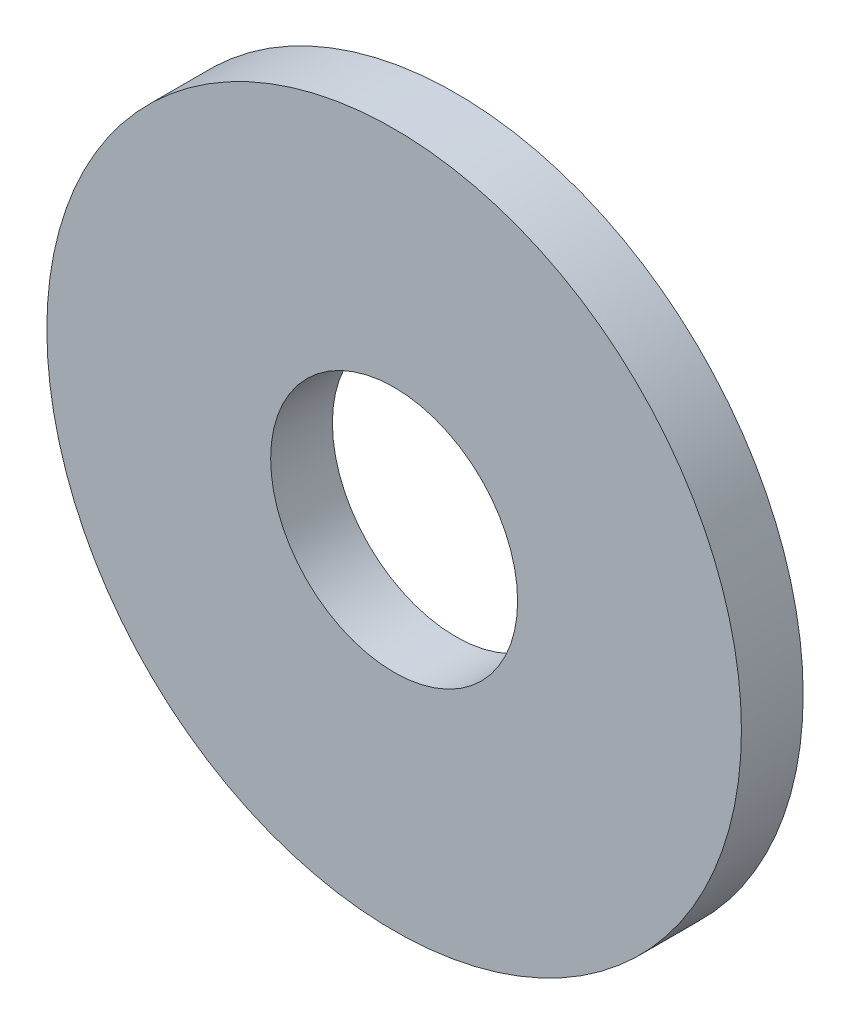
ISO-10303-21;
HEADER;
FILE_DESCRIPTION(('STEP AP214'),'2;1');
FILE_NAME('part.step','',(''),(''),'','','');
FILE_SCHEMA(('AUTOMOTIVE_DESIGN { 1 0 10303 214 1 1 1 1 }'));
ENDSEC;
DATA;
#1=APPLICATION_CONTEXT('core data for automotive mechanical design processes');
#2=APPLICATION_PROTOCOL_DEFINITION('international standard','automotive_design',2000,#1);
#3=PRODUCT_CONTEXT('',#1,'mechanical');
#4=PRODUCT('Part','Part','',(#3));
#5=PRODUCT_RELATED_PRODUCT_CATEGORY('part','',(#4));
#6=PRODUCT_DEFINITION_FORMATION('','',#4);
#7=PRODUCT_DEFINITION_CONTEXT('part definition',#1,'design');
#8=PRODUCT_DEFINITION('design','',#6,#7);
#9=PRODUCT_DEFINITION_SHAPE('','',#8);
#10=(LENGTH_UNIT() NAMED_UNIT(*) SI_UNIT(.MILLI.,.METRE.));
#11=(NAMED_UNIT(*) PLANE_ANGLE_UNIT() SI_UNIT($,.RADIAN.));
#12=(NAMED_UNIT(*) SI_UNIT($,.STERADIAN.) SOLID_ANGLE_UNIT());
#13=UNCERTAINTY_MEASURE_WITH_UNIT(LENGTH_MEASURE(1.E-05),#10,'distance_accuracy_value','');
#14=(GEOMETRIC_REPRESENTATION_CONTEXT(3) GLOBAL_UNCERTAINTY_ASSIGNED_CONTEXT((#13)) GLOBAL_UNIT_ASSIGNED_CONTEXT((#10,
#11,#12)) REPRESENTATION_CONTEXT('',''));
#15=CARTESIAN_POINT('',(0.,0.,0.));
#16=DIRECTION('',(0.,0.,1.));
#17=DIRECTION('',(1.,0.,0.));
#18=AXIS2_PLACEMENT_3D('',#15,#16,#17);
#19=CARTESIAN_POINT('',(0.,0.,0.8));
#20=DIRECTION('',(0.,0.,1.));
#21=DIRECTION('',(1.,0.,0.));
#22=AXIS2_PLACEMENT_3D('',#19,#20,#21);
#23=PLANE('',#22);
#24=CARTESIAN_POINT('',(0.,0.,0.8));
#25=DIRECTION('',(0.,0.,1.));
#26=DIRECTION('',(1.,0.,0.));
#27=AXIS2_PLACEMENT_3D('',#24,#25,#26);
#28=CIRCLE('',#27,4.5);
#29=CARTESIAN_POINT('',(4.5,0.,0.8));
#30=VERTEX_POINT('',#29);
#31=EDGE_CURVE('E10',#30,#30,#28,.T.);
#32=ORIENTED_EDGE('',*,*,#31,.T.);
#33=EDGE_LOOP('',(#32));
#34=FACE_BOUND('',#33,.T.);
#35=CARTESIAN_POINT('',(0.,0.,0.8));
#36=DIRECTION('',(0.,0.,1.));
#37=DIRECTION('',(1.,0.,0.));
#38=AXIS2_PLACEMENT_3D('',#35,#36,#37);
#39=CIRCLE('',#38,1.6);
#40=CARTESIAN_POINT('',(1.6,0.,0.8));
#41=VERTEX_POINT('',#40);
#42=EDGE_CURVE('E51',#41,#41,#39,.T.);
#43=ORIENTED_EDGE('',*,*,#42,.F.);
#44=EDGE_LOOP('',(#43));
#45=FACE_BOUND('',#44,.T.);
#46=ADVANCED_FACE('F36',(#34,#45),#23,.T.);
#47=CARTESIAN_POINT('',(0.,0.,0.));
#48=DIRECTION('',(0.,0.,1.));
#49=DIRECTION('',(1.,0.,0.));
#50=AXIS2_PLACEMENT_3D('',#47,#48,#49);
#51=PLANE('',#50);
#52=CARTESIAN_POINT('',(0.,0.,0.));
#53=DIRECTION('',(0.,0.,1.));
#54=DIRECTION('',(1.,0.,0.));
#55=AXIS2_PLACEMENT_3D('',#52,#53,#54);
#56=CIRCLE('',#55,4.5);
#57=CARTESIAN_POINT('',(4.5,0.,0.));
#58=VERTEX_POINT('',#57);
#59=EDGE_CURVE('E40',#58,#58,#56,.T.);
#60=ORIENTED_EDGE('',*,*,#59,.F.);
#61=EDGE_LOOP('',(#60));
#62=FACE_BOUND('',#61,.T.);
#63=CARTESIAN_POINT('',(0.,0.,0.));
#64=DIRECTION('',(0.,0.,1.));
#65=DIRECTION('',(1.,0.,0.));
#66=AXIS2_PLACEMENT_3D('',#63,#64,#65);
#67=CIRCLE('',#66,1.6);
#68=CARTESIAN_POINT('',(1.6,0.,0.));
#69=VERTEX_POINT('',#68);
#70=EDGE_CURVE('E53',#69,#69,#67,.T.);
#71=ORIENTED_EDGE('',*,*,#70,.T.);
#72=EDGE_LOOP('',(#71));
#73=FACE_BOUND('',#72,.T.);
#74=ADVANCED_FACE('F63',(#62,#73),#51,.F.);
#75=CARTESIAN_POINT('',(0.,0.,0.8));
#76=DIRECTION('',(0.,0.,-1.));
#77=DIRECTION('',(-1.,0.,0.));
#78=AXIS2_PLACEMENT_3D('',#75,#76,#77);
#79=CYLINDRICAL_SURFACE('',#78,4.5);
#80=ORIENTED_EDGE('',*,*,#31,.F.);
#81=EDGE_LOOP('',(#80));
#82=FACE_BOUND('',#81,.T.);
#83=ORIENTED_EDGE('',*,*,#59,.T.);
#84=EDGE_LOOP('',(#83));
#85=FACE_BOUND('',#84,.T.);
#86=ADVANCED_FACE('F38',(#82,#85),#79,.T.);
#87=CARTESIAN_POINT('',(0.,0.,0.8));
#88=DIRECTION('',(0.,0.,-1.));
#89=DIRECTION('',(-1.,0.,0.));
#90=AXIS2_PLACEMENT_3D('',#87,#88,#89);
#91=CYLINDRICAL_SURFACE('',#90,1.6);
#92=ORIENTED_EDGE('',*,*,#42,.T.);
#93=EDGE_LOOP('',(#92));
#94=FACE_BOUND('',#93,.T.);
#95=ORIENTED_EDGE('',*,*,#70,.F.);
#96=EDGE_LOOP('',(#95));
#97=FACE_BOUND('',#96,.T.);
#98=ADVANCED_FACE('F59',(#94,#97),#91,.F.);
#99=CLOSED_SHELL('',(#46,#74,#86,#98));
#100=MANIFOLD_SOLID_BREP('B2',#99);
#101=ADVANCED_BREP_SHAPE_REPRESENTATION('',(#18,#100),#14);
#102=SHAPE_DEFINITION_REPRESENTATION(#9,#101);
ENDSEC;
END-ISO-10303-21;
